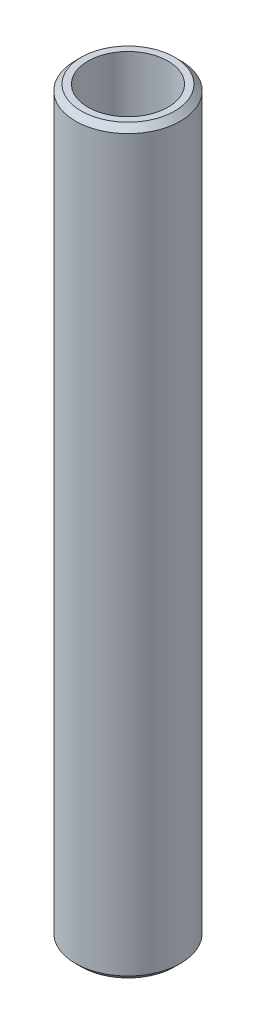
ISO-10303-21;
HEADER;
FILE_DESCRIPTION(('STEP AP214'),'2;1');
FILE_NAME('part.step','',(''),(''),'','','');
FILE_SCHEMA(('AUTOMOTIVE_DESIGN { 1 0 10303 214 1 1 1 1 }'));
ENDSEC;
DATA;
#1=APPLICATION_CONTEXT('core data for automotive mechanical design processes');
#2=APPLICATION_PROTOCOL_DEFINITION('international standard','automotive_design',2000,#1);
#3=PRODUCT_CONTEXT('',#1,'mechanical');
#4=PRODUCT('Part','Part','',(#3));
#5=PRODUCT_RELATED_PRODUCT_CATEGORY('part','',(#4));
#6=PRODUCT_DEFINITION_FORMATION('','',#4);
#7=PRODUCT_DEFINITION_CONTEXT('part definition',#1,'design');
#8=PRODUCT_DEFINITION('design','',#6,#7);
#9=PRODUCT_DEFINITION_SHAPE('','',#8);
#10=(LENGTH_UNIT() NAMED_UNIT(*) SI_UNIT(.MILLI.,.METRE.));
#11=(NAMED_UNIT(*) PLANE_ANGLE_UNIT() SI_UNIT($,.RADIAN.));
#12=(NAMED_UNIT(*) SI_UNIT($,.STERADIAN.) SOLID_ANGLE_UNIT());
#13=UNCERTAINTY_MEASURE_WITH_UNIT(LENGTH_MEASURE(1.E-05),#10,'distance_accuracy_value','');
#14=(GEOMETRIC_REPRESENTATION_CONTEXT(3) GLOBAL_UNCERTAINTY_ASSIGNED_CONTEXT((#13)) GLOBAL_UNIT_ASSIGNED_CONTEXT((#10,
#11,#12)) REPRESENTATION_CONTEXT('',''));
#15=CARTESIAN_POINT('',(0.,0.,0.));
#16=DIRECTION('',(0.,0.,1.));
#17=DIRECTION('',(1.,0.,0.));
#18=AXIS2_PLACEMENT_3D('',#15,#16,#17);
#19=CARTESIAN_POINT('',(0.,600.,0.));
#20=DIRECTION('',(0.,-1.,0.));
#21=DIRECTION('',(0.,0.,-1.));
#22=AXIS2_PLACEMENT_3D('',#19,#20,#21);
#23=CYLINDRICAL_SURFACE('',#22,42.5);
#24=CARTESIAN_POINT('',(0.,595.3007023183,0.));
#25=DIRECTION('',(0.,1.,0.));
#26=DIRECTION('',(0.,0.,1.));
#27=AXIS2_PLACEMENT_3D('',#24,#25,#26);
#28=CIRCLE('',#27,42.5);
#29=CARTESIAN_POINT('',(0.,595.3007023183,42.5));
#30=VERTEX_POINT('',#29);
#31=EDGE_CURVE('E50',#30,#30,#28,.F.);
#32=ORIENTED_EDGE('',*,*,#31,.T.);
#33=EDGE_LOOP('',(#32));
#34=FACE_BOUND('',#33,.T.);
#35=CARTESIAN_POINT('',(0.,4.69929768169941,0.));
#36=DIRECTION('',(0.,1.,0.));
#37=DIRECTION('',(0.,0.,1.));
#38=AXIS2_PLACEMENT_3D('',#35,#36,#37);
#39=CIRCLE('',#38,42.5);
#40=CARTESIAN_POINT('',(0.,4.69929768169941,42.5));
#41=VERTEX_POINT('',#40);
#42=EDGE_CURVE('E51',#41,#41,#39,.T.);
#43=ORIENTED_EDGE('',*,*,#42,.T.);
#44=EDGE_LOOP('',(#43));
#45=FACE_BOUND('',#44,.T.);
#46=ADVANCED_FACE('F39',(#34,#45),#23,.T.);
#47=CARTESIAN_POINT('',(0.,600.,0.));
#48=DIRECTION('',(0.,1.,0.));
#49=DIRECTION('',(0.,0.,1.));
#50=AXIS2_PLACEMENT_3D('',#47,#48,#49);
#51=PLANE('',#50);
#52=CARTESIAN_POINT('',(0.,600.,0.));
#53=DIRECTION('',(0.,1.,0.));
#54=DIRECTION('',(0.,0.,1.));
#55=AXIS2_PLACEMENT_3D('',#52,#53,#54);
#56=CIRCLE('',#55,37.8007023183005);
#57=CARTESIAN_POINT('',(0.,600.,37.8007023183005));
#58=VERTEX_POINT('',#57);
#59=EDGE_CURVE('E54',#58,#58,#56,.T.);
#60=ORIENTED_EDGE('',*,*,#59,.T.);
#61=EDGE_LOOP('',(#60));
#62=FACE_BOUND('',#61,.T.);
#63=CARTESIAN_POINT('',(0.,600.,0.));
#64=DIRECTION('',(0.,1.,0.));
#65=DIRECTION('',(0.,0.,1.));
#66=AXIS2_PLACEMENT_3D('',#63,#64,#65);
#67=CIRCLE('',#66,32.3879852620585);
#68=CARTESIAN_POINT('',(0.,600.,32.3879852620585));
#69=VERTEX_POINT('',#68);
#70=EDGE_CURVE('E58',#69,#69,#67,.T.);
#71=ORIENTED_EDGE('',*,*,#70,.F.);
#72=EDGE_LOOP('',(#71));
#73=FACE_BOUND('',#72,.T.);
#74=ADVANCED_FACE('F69',(#62,#73),#51,.T.);
#75=CARTESIAN_POINT('',(0.,0.,0.));
#76=DIRECTION('',(0.,1.,0.));
#77=DIRECTION('',(0.,0.,1.));
#78=AXIS2_PLACEMENT_3D('',#75,#76,#77);
#79=PLANE('',#78);
#80=CARTESIAN_POINT('',(0.,0.,0.));
#81=DIRECTION('',(0.,1.,0.));
#82=DIRECTION('',(0.,0.,1.));
#83=AXIS2_PLACEMENT_3D('',#80,#81,#82);
#84=CIRCLE('',#83,37.8007023183005);
#85=CARTESIAN_POINT('',(0.,0.,37.8007023183005));
#86=VERTEX_POINT('',#85);
#87=EDGE_CURVE('E10',#86,#86,#84,.F.);
#88=ORIENTED_EDGE('',*,*,#87,.T.);
#89=EDGE_LOOP('',(#88));
#90=FACE_BOUND('',#89,.T.);
#91=CARTESIAN_POINT('',(0.,0.,0.));
#92=DIRECTION('',(0.,1.,0.));
#93=DIRECTION('',(0.,0.,1.));
#94=AXIS2_PLACEMENT_3D('',#91,#92,#93);
#95=CIRCLE('',#94,32.3879852620585);
#96=CARTESIAN_POINT('',(0.,0.,32.3879852620585));
#97=VERTEX_POINT('',#96);
#98=EDGE_CURVE('E63',#97,#97,#95,.T.);
#99=ORIENTED_EDGE('',*,*,#98,.T.);
#100=EDGE_LOOP('',(#99));
#101=FACE_BOUND('',#100,.T.);
#102=ADVANCED_FACE('F75',(#90,#101),#79,.F.);
#103=CARTESIAN_POINT('',(0.,600.,0.));
#104=DIRECTION('',(0.,-1.,0.));
#105=DIRECTION('',(0.,0.,-1.));
#106=AXIS2_PLACEMENT_3D('',#103,#104,#105);
#107=CYLINDRICAL_SURFACE('',#106,32.3879852620585);
#108=ORIENTED_EDGE('',*,*,#70,.T.);
#109=EDGE_LOOP('',(#108));
#110=FACE_BOUND('',#109,.T.);
#111=ORIENTED_EDGE('',*,*,#98,.F.);
#112=EDGE_LOOP('',(#111));
#113=FACE_BOUND('',#112,.T.);
#114=ADVANCED_FACE('F70',(#110,#113),#107,.F.);
#115=CARTESIAN_POINT('',(0.,600.,0.));
#116=DIRECTION('',(0.,-1.,0.));
#117=DIRECTION('',(0.,0.,-1.));
#118=AXIS2_PLACEMENT_3D('',#115,#116,#117);
#119=CONICAL_SURFACE('',#118,37.8007023183005,0.785398163397439);
#120=ORIENTED_EDGE('',*,*,#31,.F.);
#121=EDGE_LOOP('',(#120));
#122=FACE_BOUND('',#121,.T.);
#123=ORIENTED_EDGE('',*,*,#59,.F.);
#124=EDGE_LOOP('',(#123));
#125=FACE_BOUND('',#124,.T.);
#126=ADVANCED_FACE('F81',(#122,#125),#119,.T.);
#127=CARTESIAN_POINT('',(0.,4.69929768169941,0.));
#128=DIRECTION('',(0.,1.,0.));
#129=DIRECTION('',(0.,0.,1.));
#130=AXIS2_PLACEMENT_3D('',#127,#128,#129);
#131=CONICAL_SURFACE('',#130,42.5,0.785398163397457);
#132=ORIENTED_EDGE('',*,*,#87,.F.);
#133=EDGE_LOOP('',(#132));
#134=FACE_BOUND('',#133,.T.);
#135=ORIENTED_EDGE('',*,*,#42,.F.);
#136=EDGE_LOOP('',(#135));
#137=FACE_BOUND('',#136,.T.);
#138=ADVANCED_FACE('F45',(#134,#137),#131,.T.);
#139=CLOSED_SHELL('',(#46,#74,#102,#114,#126,#138));
#140=MANIFOLD_SOLID_BREP('B2',#139);
#141=ADVANCED_BREP_SHAPE_REPRESENTATION('',(#18,#140),#14);
#142=SHAPE_DEFINITION_REPRESENTATION(#9,#141);
ENDSEC;
END-ISO-10303-21;
